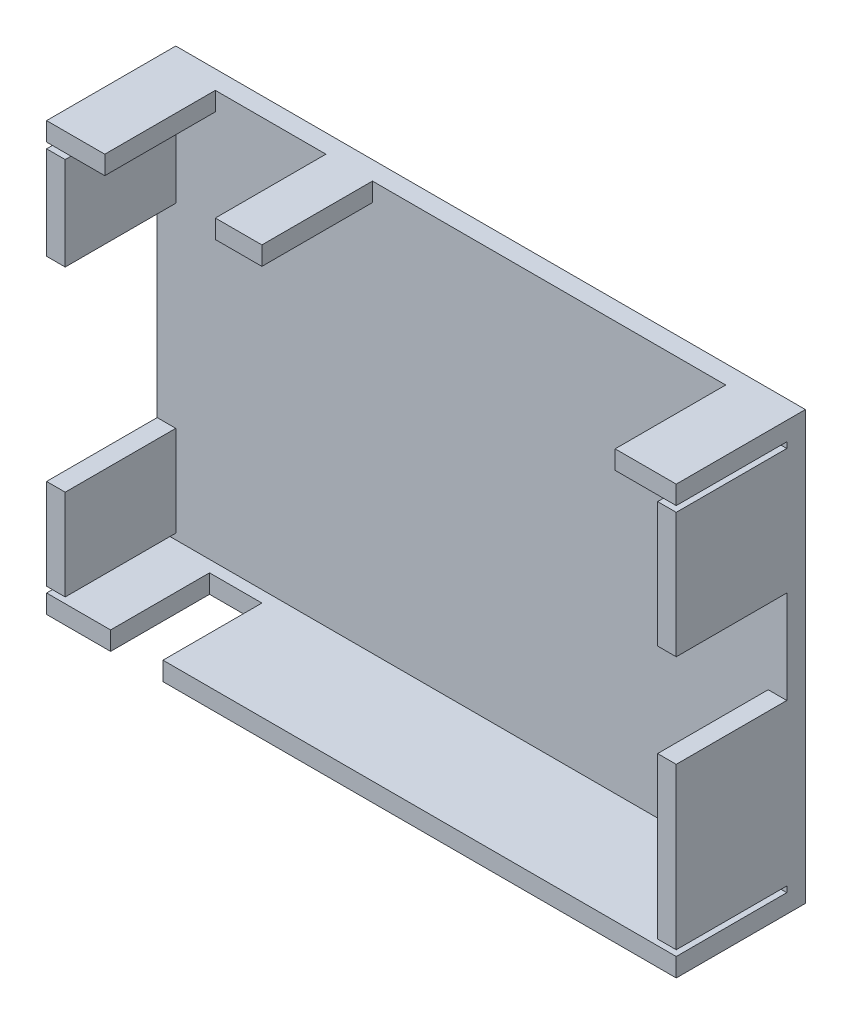
ISO-10303-21;
HEADER;
FILE_DESCRIPTION(('STEP AP214'),'2;1');
FILE_NAME('part.step','',(''),(''),'','','');
FILE_SCHEMA(('AUTOMOTIVE_DESIGN { 1 0 10303 214 1 1 1 1 }'));
ENDSEC;
DATA;
#1=APPLICATION_CONTEXT('core data for automotive mechanical design processes');
#2=APPLICATION_PROTOCOL_DEFINITION('international standard','automotive_design',2000,#1);
#3=PRODUCT_CONTEXT('',#1,'mechanical');
#4=PRODUCT('Part','Part','',(#3));
#5=PRODUCT_RELATED_PRODUCT_CATEGORY('part','',(#4));
#6=PRODUCT_DEFINITION_FORMATION('','',#4);
#7=PRODUCT_DEFINITION_CONTEXT('part definition',#1,'design');
#8=PRODUCT_DEFINITION('design','',#6,#7);
#9=PRODUCT_DEFINITION_SHAPE('','',#8);
#10=(LENGTH_UNIT() NAMED_UNIT(*) SI_UNIT(.MILLI.,.METRE.));
#11=(NAMED_UNIT(*) PLANE_ANGLE_UNIT() SI_UNIT($,.RADIAN.));
#12=(NAMED_UNIT(*) SI_UNIT($,.STERADIAN.) SOLID_ANGLE_UNIT());
#13=UNCERTAINTY_MEASURE_WITH_UNIT(LENGTH_MEASURE(1.E-05),#10,'distance_accuracy_value','');
#14=(GEOMETRIC_REPRESENTATION_CONTEXT(3) GLOBAL_UNCERTAINTY_ASSIGNED_CONTEXT((#13)) GLOBAL_UNIT_ASSIGNED_CONTEXT((#10,
#11,#12)) REPRESENTATION_CONTEXT('',''));
#15=CARTESIAN_POINT('',(0.,0.,0.));
#16=DIRECTION('',(0.,0.,1.));
#17=DIRECTION('',(1.,0.,0.));
#18=AXIS2_PLACEMENT_3D('',#15,#16,#17);
#19=CARTESIAN_POINT('',(0.,0.,22.2));
#20=DIRECTION('',(0.,0.,1.));
#21=DIRECTION('',(1.,0.,0.));
#22=AXIS2_PLACEMENT_3D('',#19,#20,#21);
#23=PLANE('',#22);
#24=DIRECTION('',(0.,1.,0.));
#25=VECTOR('',#24,1.);
#26=CARTESIAN_POINT('',(20.,3.19999999999998,22.2));
#27=LINE('',#26,#25);
#28=CARTESIAN_POINT('',(20.,0.,22.2));
#29=VERTEX_POINT('',#28);
#30=CARTESIAN_POINT('',(20.,3.19999999999998,22.2));
#31=VERTEX_POINT('',#30);
#32=EDGE_CURVE('E284',#29,#31,#27,.T.);
#33=ORIENTED_EDGE('',*,*,#32,.F.);
#34=DIRECTION('',(1.,0.,0.));
#35=VECTOR('',#34,1.);
#36=CARTESIAN_POINT('',(0.,0.,22.2));
#37=LINE('',#36,#35);
#38=CARTESIAN_POINT('',(108.2,0.,22.2));
#39=VERTEX_POINT('',#38);
#40=EDGE_CURVE('E487',#29,#39,#37,.T.);
#41=ORIENTED_EDGE('',*,*,#40,.T.);
#42=DIRECTION('',(0.,1.,0.));
#43=VECTOR('',#42,1.);
#44=CARTESIAN_POINT('',(108.2,0.,22.2));
#45=LINE('',#44,#43);
#46=CARTESIAN_POINT('',(108.2,3.2,22.2));
#47=VERTEX_POINT('',#46);
#48=EDGE_CURVE('E494',#39,#47,#45,.T.);
#49=ORIENTED_EDGE('',*,*,#48,.T.);
#50=DIRECTION('',(1.,0.,0.));
#51=VECTOR('',#50,1.);
#52=CARTESIAN_POINT('',(3.20000000000001,3.2,22.2));
#53=LINE('',#52,#51);
#54=EDGE_CURVE('E452',#31,#47,#53,.T.);
#55=ORIENTED_EDGE('',*,*,#54,.F.);
#56=EDGE_LOOP('',(#33,#41,#49,#55));
#57=FACE_BOUND('',#56,.T.);
#58=ADVANCED_FACE('F36',(#57),#23,.T.);
#59=DIRECTION('',(-1.,0.,0.));
#60=VECTOR('',#59,1.);
#61=CARTESIAN_POINT('',(105.,47.8,22.2));
#62=LINE('',#61,#60);
#63=CARTESIAN_POINT('',(108.2,47.8,22.2));
#64=VERTEX_POINT('',#63);
#65=CARTESIAN_POINT('',(105.,47.8,22.2));
#66=VERTEX_POINT('',#65);
#67=EDGE_CURVE('E300',#64,#66,#62,.T.);
#68=ORIENTED_EDGE('',*,*,#67,.F.);
#69=CARTESIAN_POINT('',(108.2,69.3,22.2));
#70=VERTEX_POINT('',#69);
#71=EDGE_CURVE('E499',#64,#70,#45,.T.);
#72=ORIENTED_EDGE('',*,*,#71,.T.);
#73=DIRECTION('',(-1.,0.,0.));
#74=VECTOR('',#73,1.);
#75=CARTESIAN_POINT('',(0.,69.3,22.2));
#76=LINE('',#75,#74);
#77=CARTESIAN_POINT('',(105.,69.3,22.2));
#78=VERTEX_POINT('',#77);
#79=EDGE_CURVE('E395',#70,#78,#76,.T.);
#80=ORIENTED_EDGE('',*,*,#79,.T.);
#81=DIRECTION('',(0.,1.,0.));
#82=VECTOR('',#81,1.);
#83=CARTESIAN_POINT('',(105.,3.2,22.2));
#84=LINE('',#83,#82);
#85=EDGE_CURVE('E455',#66,#78,#84,.T.);
#86=ORIENTED_EDGE('',*,*,#85,.F.);
#87=EDGE_LOOP('',(#68,#72,#80,#86));
#88=FACE_BOUND('',#87,.T.);
#89=ADVANCED_FACE('F645',(#88),#23,.T.);
#90=CARTESIAN_POINT('',(105.,3.2,22.2));
#91=DIRECTION('',(-1.,0.,0.));
#92=DIRECTION('',(0.,0.,1.));
#93=AXIS2_PLACEMENT_3D('',#90,#91,#92);
#94=PLANE('',#93);
#95=DIRECTION('',(0.,0.,1.));
#96=VECTOR('',#95,1.);
#97=CARTESIAN_POINT('',(105.,47.8,3.2));
#98=LINE('',#97,#96);
#99=CARTESIAN_POINT('',(105.,47.8,3.2));
#100=VERTEX_POINT('',#99);
#101=EDGE_CURVE('E308',#100,#66,#98,.T.);
#102=ORIENTED_EDGE('',*,*,#101,.T.);
#103=ORIENTED_EDGE('',*,*,#85,.T.);
#104=DIRECTION('',(0.,0.,1.));
#105=VECTOR('',#104,1.);
#106=CARTESIAN_POINT('',(105.,69.3,3.2));
#107=LINE('',#106,#105);
#108=CARTESIAN_POINT('',(105.,69.3,3.2));
#109=VERTEX_POINT('',#108);
#110=EDGE_CURVE('E391',#109,#78,#107,.T.);
#111=ORIENTED_EDGE('',*,*,#110,.F.);
#112=DIRECTION('',(0.,1.,0.));
#113=VECTOR('',#112,1.);
#114=CARTESIAN_POINT('',(105.,3.2,3.2));
#115=LINE('',#114,#113);
#116=EDGE_CURVE('E470',#100,#109,#115,.T.);
#117=ORIENTED_EDGE('',*,*,#116,.F.);
#118=EDGE_LOOP('',(#102,#103,#111,#117));
#119=FACE_BOUND('',#118,.T.);
#120=ADVANCED_FACE('F641',(#119),#94,.T.);
#121=DIRECTION('',(0.,1.,0.));
#122=VECTOR('',#121,1.);
#123=CARTESIAN_POINT('',(29.,73.5,22.2));
#124=LINE('',#123,#122);
#125=CARTESIAN_POINT('',(29.,70.3,22.2));
#126=VERTEX_POINT('',#125);
#127=CARTESIAN_POINT('',(29.,73.5,22.2));
#128=VERTEX_POINT('',#127);
#129=EDGE_CURVE('E322',#126,#128,#124,.T.);
#130=ORIENTED_EDGE('',*,*,#129,.F.);
#131=DIRECTION('',(-1.,0.,0.));
#132=VECTOR('',#131,1.);
#133=CARTESIAN_POINT('',(3.20000000000001,70.3,22.2));
#134=LINE('',#133,#132);
#135=CARTESIAN_POINT('',(37.,70.3,22.2));
#136=VERTEX_POINT('',#135);
#137=EDGE_CURVE('E464',#136,#126,#134,.T.);
#138=ORIENTED_EDGE('',*,*,#137,.F.);
#139=DIRECTION('',(0.,-1.,0.));
#140=VECTOR('',#139,1.);
#141=CARTESIAN_POINT('',(37.,73.5,22.2));
#142=LINE('',#141,#140);
#143=CARTESIAN_POINT('',(37.,73.5,22.2));
#144=VERTEX_POINT('',#143);
#145=EDGE_CURVE('E311',#144,#136,#142,.T.);
#146=ORIENTED_EDGE('',*,*,#145,.F.);
#147=DIRECTION('',(-1.,0.,0.));
#148=VECTOR('',#147,1.);
#149=CARTESIAN_POINT('',(108.2,73.5,22.2));
#150=LINE('',#149,#148);
#151=EDGE_CURVE('E483',#144,#128,#150,.T.);
#152=ORIENTED_EDGE('',*,*,#151,.T.);
#153=EDGE_LOOP('',(#130,#138,#146,#152));
#154=FACE_BOUND('',#153,.T.);
#155=ADVANCED_FACE('F549',(#154),#23,.T.);
#156=DIRECTION('',(0.,1.,0.));
#157=VECTOR('',#156,1.);
#158=CARTESIAN_POINT('',(97.7,73.5,22.2));
#159=LINE('',#158,#157);
#160=CARTESIAN_POINT('',(97.7,70.3,22.2));
#161=VERTEX_POINT('',#160);
#162=CARTESIAN_POINT('',(97.7,73.5,22.2));
#163=VERTEX_POINT('',#162);
#164=EDGE_CURVE('E346',#161,#163,#159,.T.);
#165=ORIENTED_EDGE('',*,*,#164,.F.);
#166=CARTESIAN_POINT('',(108.2,70.3,22.2));
#167=VERTEX_POINT('',#166);
#168=EDGE_CURVE('E460',#167,#161,#134,.T.);
#169=ORIENTED_EDGE('',*,*,#168,.F.);
#170=CARTESIAN_POINT('',(108.2,73.5,22.2));
#171=VERTEX_POINT('',#170);
#172=EDGE_CURVE('E493',#167,#171,#45,.T.);
#173=ORIENTED_EDGE('',*,*,#172,.T.);
#174=EDGE_CURVE('E479',#171,#163,#150,.T.);
#175=ORIENTED_EDGE('',*,*,#174,.T.);
#176=EDGE_LOOP('',(#165,#169,#173,#175));
#177=FACE_BOUND('',#176,.T.);
#178=ADVANCED_FACE('F625',(#177),#23,.T.);
#179=CARTESIAN_POINT('',(3.20000000000001,70.3,22.2));
#180=DIRECTION('',(0.,-1.,0.));
#181=DIRECTION('',(0.,0.,-1.));
#182=AXIS2_PLACEMENT_3D('',#179,#180,#181);
#183=PLANE('',#182);
#184=DIRECTION('',(0.,0.,1.));
#185=VECTOR('',#184,1.);
#186=CARTESIAN_POINT('',(29.,70.3,3.2));
#187=LINE('',#186,#185);
#188=CARTESIAN_POINT('',(29.,70.3,3.2));
#189=VERTEX_POINT('',#188);
#190=EDGE_CURVE('E336',#189,#126,#187,.T.);
#191=ORIENTED_EDGE('',*,*,#190,.F.);
#192=DIRECTION('',(-1.,0.,0.));
#193=VECTOR('',#192,1.);
#194=CARTESIAN_POINT('',(3.20000000000001,70.3,3.2));
#195=LINE('',#194,#193);
#196=CARTESIAN_POINT('',(37.,70.3,3.2));
#197=VERTEX_POINT('',#196);
#198=EDGE_CURVE('E478',#197,#189,#195,.T.);
#199=ORIENTED_EDGE('',*,*,#198,.F.);
#200=DIRECTION('',(0.,0.,1.));
#201=VECTOR('',#200,1.);
#202=CARTESIAN_POINT('',(37.,70.3,3.2));
#203=LINE('',#202,#201);
#204=EDGE_CURVE('E358',#197,#136,#203,.T.);
#205=ORIENTED_EDGE('',*,*,#204,.T.);
#206=ORIENTED_EDGE('',*,*,#137,.T.);
#207=EDGE_LOOP('',(#191,#199,#205,#206));
#208=FACE_BOUND('',#207,.T.);
#209=ADVANCED_FACE('F817',(#208),#183,.T.);
#210=DIRECTION('',(0.,0.,1.));
#211=VECTOR('',#210,1.);
#212=CARTESIAN_POINT('',(97.7,70.3,3.2));
#213=LINE('',#212,#211);
#214=CARTESIAN_POINT('',(97.7,70.3,3.2));
#215=VERTEX_POINT('',#214);
#216=EDGE_CURVE('E356',#215,#161,#213,.T.);
#217=ORIENTED_EDGE('',*,*,#216,.F.);
#218=CARTESIAN_POINT('',(108.2,70.3,3.2));
#219=VERTEX_POINT('',#218);
#220=EDGE_CURVE('E475',#219,#215,#195,.T.);
#221=ORIENTED_EDGE('',*,*,#220,.F.);
#222=DIRECTION('',(0.,0.,1.));
#223=VECTOR('',#222,1.);
#224=CARTESIAN_POINT('',(108.2,70.3,3.2));
#225=LINE('',#224,#223);
#226=EDGE_CURVE('E388',#219,#167,#225,.T.);
#227=ORIENTED_EDGE('',*,*,#226,.T.);
#228=ORIENTED_EDGE('',*,*,#168,.T.);
#229=EDGE_LOOP('',(#217,#221,#227,#228));
#230=FACE_BOUND('',#229,.T.);
#231=ADVANCED_FACE('F633',(#230),#183,.T.);
#232=DIRECTION('',(-1.,0.,0.));
#233=VECTOR('',#232,1.);
#234=CARTESIAN_POINT('',(0.,53.3,22.2));
#235=LINE('',#234,#233);
#236=CARTESIAN_POINT('',(3.20000000000001,53.3,22.2));
#237=VERTEX_POINT('',#236);
#238=CARTESIAN_POINT('',(0.,53.3,22.2));
#239=VERTEX_POINT('',#238);
#240=EDGE_CURVE('E366',#237,#239,#235,.T.);
#241=ORIENTED_EDGE('',*,*,#240,.F.);
#242=DIRECTION('',(0.,-1.,0.));
#243=VECTOR('',#242,1.);
#244=CARTESIAN_POINT('',(3.20000000000001,3.2,22.2));
#245=LINE('',#244,#243);
#246=CARTESIAN_POINT('',(3.20000000000001,69.3,22.2));
#247=VERTEX_POINT('',#246);
#248=EDGE_CURVE('E449',#247,#237,#245,.T.);
#249=ORIENTED_EDGE('',*,*,#248,.F.);
#250=DIRECTION('',(1.,0.,0.));
#251=VECTOR('',#250,1.);
#252=CARTESIAN_POINT('',(0.,69.3,22.2));
#253=LINE('',#252,#251);
#254=CARTESIAN_POINT('',(0.,69.3,22.2));
#255=VERTEX_POINT('',#254);
#256=EDGE_CURVE('E398',#255,#247,#253,.T.);
#257=ORIENTED_EDGE('',*,*,#256,.F.);
#258=DIRECTION('',(0.,-1.,0.));
#259=VECTOR('',#258,1.);
#260=CARTESIAN_POINT('',(0.,73.5,22.2));
#261=LINE('',#260,#259);
#262=EDGE_CURVE('E488',#255,#239,#261,.T.);
#263=ORIENTED_EDGE('',*,*,#262,.T.);
#264=EDGE_LOOP('',(#241,#249,#257,#263));
#265=FACE_BOUND('',#264,.T.);
#266=ADVANCED_FACE('F576',(#265),#23,.T.);
#267=CARTESIAN_POINT('',(3.20000000000001,3.2,22.2));
#268=DIRECTION('',(1.,0.,0.));
#269=DIRECTION('',(0.,1.,0.));
#270=AXIS2_PLACEMENT_3D('',#267,#268,#269);
#271=PLANE('',#270);
#272=DIRECTION('',(0.,0.,1.));
#273=VECTOR('',#272,1.);
#274=CARTESIAN_POINT('',(3.20000000000001,53.3,3.2));
#275=LINE('',#274,#273);
#276=CARTESIAN_POINT('',(3.20000000000001,53.3,3.2));
#277=VERTEX_POINT('',#276);
#278=EDGE_CURVE('E378',#277,#237,#275,.T.);
#279=ORIENTED_EDGE('',*,*,#278,.F.);
#280=DIRECTION('',(0.,-1.,0.));
#281=VECTOR('',#280,1.);
#282=CARTESIAN_POINT('',(3.20000000000001,3.2,3.2));
#283=LINE('',#282,#281);
#284=CARTESIAN_POINT('',(3.20000000000001,69.3,3.2));
#285=VERTEX_POINT('',#284);
#286=EDGE_CURVE('E465',#285,#277,#283,.T.);
#287=ORIENTED_EDGE('',*,*,#286,.F.);
#288=DIRECTION('',(0.,0.,1.));
#289=VECTOR('',#288,1.);
#290=CARTESIAN_POINT('',(3.20000000000001,69.3,3.2));
#291=LINE('',#290,#289);
#292=EDGE_CURVE('E445',#285,#247,#291,.T.);
#293=ORIENTED_EDGE('',*,*,#292,.T.);
#294=ORIENTED_EDGE('',*,*,#248,.T.);
#295=EDGE_LOOP('',(#279,#287,#293,#294));
#296=FACE_BOUND('',#295,.T.);
#297=ADVANCED_FACE('F579',(#296),#271,.T.);
#298=CARTESIAN_POINT('',(0.,0.,3.2));
#299=DIRECTION('',(1.,0.,0.));
#300=DIRECTION('',(0.,0.,-1.));
#301=AXIS2_PLACEMENT_3D('',#298,#299,#300);
#302=PLANE('',#301);
#303=DIRECTION('',(0.,-1.,0.));
#304=VECTOR('',#303,1.);
#305=CARTESIAN_POINT('',(0.,53.3,3.2));
#306=LINE('',#305,#304);
#307=CARTESIAN_POINT('',(0.,53.3,3.2));
#308=VERTEX_POINT('',#307);
#309=CARTESIAN_POINT('',(0.,19.8,3.2));
#310=VERTEX_POINT('',#309);
#311=EDGE_CURVE('E362',#308,#310,#306,.T.);
#312=ORIENTED_EDGE('',*,*,#311,.F.);
#313=DIRECTION('',(0.,0.,1.));
#314=VECTOR('',#313,1.);
#315=CARTESIAN_POINT('',(0.,53.3,3.2));
#316=LINE('',#315,#314);
#317=EDGE_CURVE('E374',#308,#239,#316,.T.);
#318=ORIENTED_EDGE('',*,*,#317,.T.);
#319=ORIENTED_EDGE('',*,*,#262,.F.);
#320=DIRECTION('',(0.,0.,1.));
#321=VECTOR('',#320,1.);
#322=CARTESIAN_POINT('',(0.,69.3,3.2));
#323=LINE('',#322,#321);
#324=CARTESIAN_POINT('',(0.,69.3,3.2));
#325=VERTEX_POINT('',#324);
#326=EDGE_CURVE('E439',#325,#255,#323,.T.);
#327=ORIENTED_EDGE('',*,*,#326,.F.);
#328=DIRECTION('',(0.,-1.,0.));
#329=VECTOR('',#328,1.);
#330=CARTESIAN_POINT('',(0.,0.,3.2));
#331=LINE('',#330,#329);
#332=CARTESIAN_POINT('',(0.,70.3,3.2));
#333=VERTEX_POINT('',#332);
#334=EDGE_CURVE('E434',#333,#325,#331,.T.);
#335=ORIENTED_EDGE('',*,*,#334,.F.);
#336=DIRECTION('',(0.,0.,1.));
#337=VECTOR('',#336,1.);
#338=CARTESIAN_POINT('',(0.,70.3,3.2));
#339=LINE('',#338,#337);
#340=CARTESIAN_POINT('',(0.,70.3,22.2));
#341=VERTEX_POINT('',#340);
#342=EDGE_CURVE('E441',#333,#341,#339,.T.);
#343=ORIENTED_EDGE('',*,*,#342,.T.);
#344=CARTESIAN_POINT('',(0.,73.5,22.2));
#345=VERTEX_POINT('',#344);
#346=EDGE_CURVE('E484',#345,#341,#261,.T.);
#347=ORIENTED_EDGE('',*,*,#346,.F.);
#348=DIRECTION('',(0.,0.,-1.));
#349=VECTOR('',#348,1.);
#350=CARTESIAN_POINT('',(0.,73.5,3.2));
#351=LINE('',#350,#349);
#352=CARTESIAN_POINT('',(0.,73.5,0.));
#353=VERTEX_POINT('',#352);
#354=EDGE_CURVE('E508',#345,#353,#351,.T.);
#355=ORIENTED_EDGE('',*,*,#354,.T.);
#356=DIRECTION('',(0.,-1.,0.));
#357=VECTOR('',#356,1.);
#358=CARTESIAN_POINT('',(0.,0.,0.));
#359=LINE('',#358,#357);
#360=CARTESIAN_POINT('',(0.,0.,0.));
#361=VERTEX_POINT('',#360);
#362=EDGE_CURVE('E497',#353,#361,#359,.T.);
#363=ORIENTED_EDGE('',*,*,#362,.T.);
#364=DIRECTION('',(0.,0.,-1.));
#365=VECTOR('',#364,1.);
#366=CARTESIAN_POINT('',(0.,0.,3.2));
#367=LINE('',#366,#365);
#368=CARTESIAN_POINT('',(0.,0.,22.2));
#369=VERTEX_POINT('',#368);
#370=EDGE_CURVE('E11',#369,#361,#367,.T.);
#371=ORIENTED_EDGE('',*,*,#370,.F.);
#372=CARTESIAN_POINT('',(0.,3.2,22.2));
#373=VERTEX_POINT('',#372);
#374=EDGE_CURVE('E482',#373,#369,#261,.T.);
#375=ORIENTED_EDGE('',*,*,#374,.F.);
#376=DIRECTION('',(0.,0.,1.));
#377=VECTOR('',#376,1.);
#378=CARTESIAN_POINT('',(0.,3.2,3.2));
#379=LINE('',#378,#377);
#380=CARTESIAN_POINT('',(0.,3.2,3.2));
#381=VERTEX_POINT('',#380);
#382=EDGE_CURVE('E424',#381,#373,#379,.T.);
#383=ORIENTED_EDGE('',*,*,#382,.F.);
#384=DIRECTION('',(0.,1.,0.));
#385=VECTOR('',#384,1.);
#386=CARTESIAN_POINT('',(0.,3.2,3.2));
#387=LINE('',#386,#385);
#388=CARTESIAN_POINT('',(0.,4.2,3.2));
#389=VERTEX_POINT('',#388);
#390=EDGE_CURVE('E429',#381,#389,#387,.T.);
#391=ORIENTED_EDGE('',*,*,#390,.T.);
#392=DIRECTION('',(0.,0.,1.));
#393=VECTOR('',#392,1.);
#394=CARTESIAN_POINT('',(0.,4.2,3.2));
#395=LINE('',#394,#393);
#396=CARTESIAN_POINT('',(0.,4.2,22.2));
#397=VERTEX_POINT('',#396);
#398=EDGE_CURVE('E377',#389,#397,#395,.T.);
#399=ORIENTED_EDGE('',*,*,#398,.T.);
#400=CARTESIAN_POINT('',(0.,19.8,22.2));
#401=VERTEX_POINT('',#400);
#402=EDGE_CURVE('E489',#401,#397,#261,.T.);
#403=ORIENTED_EDGE('',*,*,#402,.F.);
#404=DIRECTION('',(0.,0.,1.));
#405=VECTOR('',#404,1.);
#406=CARTESIAN_POINT('',(0.,19.8,3.2));
#407=LINE('',#406,#405);
#408=EDGE_CURVE('E371',#310,#401,#407,.T.);
#409=ORIENTED_EDGE('',*,*,#408,.F.);
#410=EDGE_LOOP('',(#312,#318,#319,#327,#335,#343,#347,#355,#363,#371,#375,#383,#391,#399,#403,#409));
#411=FACE_BOUND('',#410,.T.);
#412=ADVANCED_FACE('F38',(#411),#302,.F.);
#413=CARTESIAN_POINT('',(108.2,0.,3.2));
#414=DIRECTION('',(-1.,0.,0.));
#415=DIRECTION('',(0.,0.,1.));
#416=AXIS2_PLACEMENT_3D('',#413,#414,#415);
#417=PLANE('',#416);
#418=ORIENTED_EDGE('',*,*,#71,.F.);
#419=DIRECTION('',(0.,0.,1.));
#420=VECTOR('',#419,1.);
#421=CARTESIAN_POINT('',(108.2,47.8,3.2));
#422=LINE('',#421,#420);
#423=CARTESIAN_POINT('',(108.2,47.8,3.2));
#424=VERTEX_POINT('',#423);
#425=EDGE_CURVE('E312',#424,#64,#422,.T.);
#426=ORIENTED_EDGE('',*,*,#425,.F.);
#427=DIRECTION('',(0.,1.,0.));
#428=VECTOR('',#427,1.);
#429=CARTESIAN_POINT('',(108.2,31.8,3.2));
#430=LINE('',#429,#428);
#431=CARTESIAN_POINT('',(108.2,31.8,3.2));
#432=VERTEX_POINT('',#431);
#433=EDGE_CURVE('E299',#432,#424,#430,.T.);
#434=ORIENTED_EDGE('',*,*,#433,.F.);
#435=DIRECTION('',(0.,0.,1.));
#436=VECTOR('',#435,1.);
#437=CARTESIAN_POINT('',(108.2,31.8,3.2));
#438=LINE('',#437,#436);
#439=CARTESIAN_POINT('',(108.2,31.8,22.2));
#440=VERTEX_POINT('',#439);
#441=EDGE_CURVE('E314',#432,#440,#438,.T.);
#442=ORIENTED_EDGE('',*,*,#441,.T.);
#443=CARTESIAN_POINT('',(108.2,4.2,22.2));
#444=VERTEX_POINT('',#443);
#445=EDGE_CURVE('E498',#444,#440,#45,.T.);
#446=ORIENTED_EDGE('',*,*,#445,.F.);
#447=DIRECTION('',(0.,0.,1.));
#448=VECTOR('',#447,1.);
#449=CARTESIAN_POINT('',(108.2,4.2,3.2));
#450=LINE('',#449,#448);
#451=CARTESIAN_POINT('',(108.2,4.2,3.2));
#452=VERTEX_POINT('',#451);
#453=EDGE_CURVE('E404',#452,#444,#450,.T.);
#454=ORIENTED_EDGE('',*,*,#453,.F.);
#455=DIRECTION('',(0.,1.,0.));
#456=VECTOR('',#455,1.);
#457=CARTESIAN_POINT('',(108.2,0.,3.2));
#458=LINE('',#457,#456);
#459=CARTESIAN_POINT('',(108.2,3.2,3.2));
#460=VERTEX_POINT('',#459);
#461=EDGE_CURVE('E415',#460,#452,#458,.T.);
#462=ORIENTED_EDGE('',*,*,#461,.F.);
#463=DIRECTION('',(0.,0.,1.));
#464=VECTOR('',#463,1.);
#465=CARTESIAN_POINT('',(108.2,3.2,3.2));
#466=LINE('',#465,#464);
#467=EDGE_CURVE('E410',#460,#47,#466,.T.);
#468=ORIENTED_EDGE('',*,*,#467,.T.);
#469=ORIENTED_EDGE('',*,*,#48,.F.);
#470=DIRECTION('',(0.,0.,-1.));
#471=VECTOR('',#470,1.);
#472=CARTESIAN_POINT('',(108.2,0.,3.2));
#473=LINE('',#472,#471);
#474=CARTESIAN_POINT('',(108.2,0.,0.));
#475=VERTEX_POINT('',#474);
#476=EDGE_CURVE('E44',#39,#475,#473,.T.);
#477=ORIENTED_EDGE('',*,*,#476,.T.);
#478=DIRECTION('',(0.,1.,0.));
#479=VECTOR('',#478,1.);
#480=CARTESIAN_POINT('',(108.2,0.,0.));
#481=LINE('',#480,#479);
#482=CARTESIAN_POINT('',(108.2,73.5,0.));
#483=VERTEX_POINT('',#482);
#484=EDGE_CURVE('E504',#475,#483,#481,.T.);
#485=ORIENTED_EDGE('',*,*,#484,.T.);
#486=DIRECTION('',(0.,0.,-1.));
#487=VECTOR('',#486,1.);
#488=CARTESIAN_POINT('',(108.2,73.5,3.2));
#489=LINE('',#488,#487);
#490=EDGE_CURVE('E511',#171,#483,#489,.T.);
#491=ORIENTED_EDGE('',*,*,#490,.F.);
#492=ORIENTED_EDGE('',*,*,#172,.F.);
#493=ORIENTED_EDGE('',*,*,#226,.F.);
#494=DIRECTION('',(0.,1.,0.));
#495=VECTOR('',#494,1.);
#496=CARTESIAN_POINT('',(108.2,0.,3.2));
#497=LINE('',#496,#495);
#498=CARTESIAN_POINT('',(108.2,69.3,3.2));
#499=VERTEX_POINT('',#498);
#500=EDGE_CURVE('E387',#499,#219,#497,.T.);
#501=ORIENTED_EDGE('',*,*,#500,.F.);
#502=DIRECTION('',(0.,0.,1.));
#503=VECTOR('',#502,1.);
#504=CARTESIAN_POINT('',(108.2,69.3,3.2));
#505=LINE('',#504,#503);
#506=EDGE_CURVE('E384',#499,#70,#505,.T.);
#507=ORIENTED_EDGE('',*,*,#506,.T.);
#508=EDGE_LOOP('',(#418,#426,#434,#442,#446,#454,#462,#468,#469,#477,#485,#491,#492,#493,#501,#507));
#509=FACE_BOUND('',#508,.T.);
#510=ADVANCED_FACE('F519',(#509),#417,.F.);
#511=DIRECTION('',(1.,0.,0.));
#512=VECTOR('',#511,1.);
#513=CARTESIAN_POINT('',(0.,19.8,22.2));
#514=LINE('',#513,#512);
#515=CARTESIAN_POINT('',(3.20000000000001,19.8,22.2));
#516=VERTEX_POINT('',#515);
#517=EDGE_CURVE('E335',#401,#516,#514,.T.);
#518=ORIENTED_EDGE('',*,*,#517,.F.);
#519=ORIENTED_EDGE('',*,*,#402,.T.);
#520=DIRECTION('',(1.,0.,0.));
#521=VECTOR('',#520,1.);
#522=CARTESIAN_POINT('',(0.,4.2,22.2));
#523=LINE('',#522,#521);
#524=CARTESIAN_POINT('',(3.20000000000001,4.2,22.2));
#525=VERTEX_POINT('',#524);
#526=EDGE_CURVE('E413',#397,#525,#523,.T.);
#527=ORIENTED_EDGE('',*,*,#526,.T.);
#528=EDGE_CURVE('E453',#516,#525,#245,.T.);
#529=ORIENTED_EDGE('',*,*,#528,.F.);
#530=EDGE_LOOP('',(#518,#519,#527,#529));
#531=FACE_BOUND('',#530,.T.);
#532=ADVANCED_FACE('F590',(#531),#23,.T.);
#533=DIRECTION('',(0.,-1.,0.));
#534=VECTOR('',#533,1.);
#535=CARTESIAN_POINT('',(11.,3.19999999999998,22.2));
#536=LINE('',#535,#534);
#537=CARTESIAN_POINT('',(11.,3.19999999999998,22.2));
#538=VERTEX_POINT('',#537);
#539=CARTESIAN_POINT('',(11.,0.,22.2));
#540=VERTEX_POINT('',#539);
#541=EDGE_CURVE('E1001',#538,#540,#536,.T.);
#542=ORIENTED_EDGE('',*,*,#541,.F.);
#543=EDGE_CURVE('E289',#373,#538,#53,.T.);
#544=ORIENTED_EDGE('',*,*,#543,.F.);
#545=ORIENTED_EDGE('',*,*,#374,.T.);
#546=EDGE_CURVE('E490',#369,#540,#37,.T.);
#547=ORIENTED_EDGE('',*,*,#546,.T.);
#548=EDGE_LOOP('',(#542,#544,#545,#547));
#549=FACE_BOUND('',#548,.T.);
#550=ADVANCED_FACE('F671',(#549),#23,.T.);
#551=DIRECTION('',(1.,0.,0.));
#552=VECTOR('',#551,1.);
#553=CARTESIAN_POINT('',(105.,31.8,22.2));
#554=LINE('',#553,#552);
#555=CARTESIAN_POINT('',(105.,31.8,22.2));
#556=VERTEX_POINT('',#555);
#557=EDGE_CURVE('E304',#556,#440,#554,.T.);
#558=ORIENTED_EDGE('',*,*,#557,.F.);
#559=CARTESIAN_POINT('',(105.,4.2,22.2));
#560=VERTEX_POINT('',#559);
#561=EDGE_CURVE('E456',#560,#556,#84,.T.);
#562=ORIENTED_EDGE('',*,*,#561,.F.);
#563=DIRECTION('',(-1.,0.,0.));
#564=VECTOR('',#563,1.);
#565=CARTESIAN_POINT('',(0.,4.2,22.2));
#566=LINE('',#565,#564);
#567=EDGE_CURVE('E394',#444,#560,#566,.T.);
#568=ORIENTED_EDGE('',*,*,#567,.F.);
#569=ORIENTED_EDGE('',*,*,#445,.T.);
#570=EDGE_LOOP('',(#558,#562,#568,#569));
#571=FACE_BOUND('',#570,.T.);
#572=ADVANCED_FACE('F621',(#571),#23,.T.);
#573=DIRECTION('',(0.,-1.,0.));
#574=VECTOR('',#573,1.);
#575=CARTESIAN_POINT('',(10.,73.5,22.2));
#576=LINE('',#575,#574);
#577=CARTESIAN_POINT('',(10.,73.5,22.2));
#578=VERTEX_POINT('',#577);
#579=CARTESIAN_POINT('',(10.,70.3,22.2));
#580=VERTEX_POINT('',#579);
#581=EDGE_CURVE('E328',#578,#580,#576,.T.);
#582=ORIENTED_EDGE('',*,*,#581,.F.);
#583=EDGE_CURVE('E463',#578,#345,#150,.T.);
#584=ORIENTED_EDGE('',*,*,#583,.T.);
#585=ORIENTED_EDGE('',*,*,#346,.T.);
#586=EDGE_CURVE('E459',#580,#341,#134,.T.);
#587=ORIENTED_EDGE('',*,*,#586,.F.);
#588=EDGE_LOOP('',(#582,#584,#585,#587));
#589=FACE_BOUND('',#588,.T.);
#590=ADVANCED_FACE('F542',(#589),#23,.T.);
#591=DIRECTION('',(0.,0.,1.));
#592=VECTOR('',#591,1.);
#593=CARTESIAN_POINT('',(3.20000000000001,19.8,3.2));
#594=LINE('',#593,#592);
#595=CARTESIAN_POINT('',(3.20000000000001,19.8,3.2));
#596=VERTEX_POINT('',#595);
#597=EDGE_CURVE('E380',#596,#516,#594,.T.);
#598=ORIENTED_EDGE('',*,*,#597,.T.);
#599=ORIENTED_EDGE('',*,*,#528,.T.);
#600=DIRECTION('',(0.,0.,1.));
#601=VECTOR('',#600,1.);
#602=CARTESIAN_POINT('',(3.20000000000001,4.2,3.2));
#603=LINE('',#602,#601);
#604=CARTESIAN_POINT('',(3.20000000000001,4.2,3.2));
#605=VERTEX_POINT('',#604);
#606=EDGE_CURVE('E421',#605,#525,#603,.T.);
#607=ORIENTED_EDGE('',*,*,#606,.F.);
#608=EDGE_CURVE('E444',#596,#605,#283,.T.);
#609=ORIENTED_EDGE('',*,*,#608,.F.);
#610=EDGE_LOOP('',(#598,#599,#607,#609));
#611=FACE_BOUND('',#610,.T.);
#612=ADVANCED_FACE('F594',(#611),#271,.T.);
#613=DIRECTION('',(0.,0.,1.));
#614=VECTOR('',#613,1.);
#615=CARTESIAN_POINT('',(105.,31.8,3.2));
#616=LINE('',#615,#614);
#617=CARTESIAN_POINT('',(105.,31.8,3.2));
#618=VERTEX_POINT('',#617);
#619=EDGE_CURVE('E303',#618,#556,#616,.T.);
#620=ORIENTED_EDGE('',*,*,#619,.F.);
#621=CARTESIAN_POINT('',(105.,4.2,3.2));
#622=VERTEX_POINT('',#621);
#623=EDGE_CURVE('E471',#622,#618,#115,.T.);
#624=ORIENTED_EDGE('',*,*,#623,.F.);
#625=DIRECTION('',(0.,0.,1.));
#626=VECTOR('',#625,1.);
#627=CARTESIAN_POINT('',(105.,4.2,3.2));
#628=LINE('',#627,#626);
#629=EDGE_CURVE('E407',#622,#560,#628,.T.);
#630=ORIENTED_EDGE('',*,*,#629,.T.);
#631=ORIENTED_EDGE('',*,*,#561,.T.);
#632=EDGE_LOOP('',(#620,#624,#630,#631));
#633=FACE_BOUND('',#632,.T.);
#634=ADVANCED_FACE('F615',(#633),#94,.T.);
#635=CARTESIAN_POINT('',(0.,0.,3.2));
#636=DIRECTION('',(0.,1.,0.));
#637=DIRECTION('',(0.,0.,1.));
#638=AXIS2_PLACEMENT_3D('',#635,#636,#637);
#639=PLANE('',#638);
#640=ORIENTED_EDGE('',*,*,#40,.F.);
#641=DIRECTION('',(0.,0.,1.));
#642=VECTOR('',#641,1.);
#643=CARTESIAN_POINT('',(20.,0.,5.2));
#644=LINE('',#643,#642);
#645=CARTESIAN_POINT('',(20.,0.,5.2));
#646=VERTEX_POINT('',#645);
#647=EDGE_CURVE('E291',#646,#29,#644,.T.);
#648=ORIENTED_EDGE('',*,*,#647,.F.);
#649=DIRECTION('',(1.,0.,0.));
#650=VECTOR('',#649,1.);
#651=CARTESIAN_POINT('',(11.,0.,5.2));
#652=LINE('',#651,#650);
#653=CARTESIAN_POINT('',(11.,0.,5.2));
#654=VERTEX_POINT('',#653);
#655=EDGE_CURVE('E277',#654,#646,#652,.T.);
#656=ORIENTED_EDGE('',*,*,#655,.F.);
#657=DIRECTION('',(0.,0.,1.));
#658=VECTOR('',#657,1.);
#659=CARTESIAN_POINT('',(11.,0.,5.2));
#660=LINE('',#659,#658);
#661=EDGE_CURVE('E275',#654,#540,#660,.T.);
#662=ORIENTED_EDGE('',*,*,#661,.T.);
#663=ORIENTED_EDGE('',*,*,#546,.F.);
#664=ORIENTED_EDGE('',*,*,#370,.T.);
#665=DIRECTION('',(1.,0.,0.));
#666=VECTOR('',#665,1.);
#667=CARTESIAN_POINT('',(0.,0.,0.));
#668=LINE('',#667,#666);
#669=EDGE_CURVE('E502',#361,#475,#668,.T.);
#670=ORIENTED_EDGE('',*,*,#669,.T.);
#671=ORIENTED_EDGE('',*,*,#476,.F.);
#672=EDGE_LOOP('',(#640,#648,#656,#662,#663,#664,#670,#671));
#673=FACE_BOUND('',#672,.T.);
#674=ADVANCED_FACE('F700',(#673),#639,.F.);
#675=CARTESIAN_POINT('',(0.,73.5,3.2));
#676=DIRECTION('',(0.,-1.,0.));
#677=DIRECTION('',(0.,0.,-1.));
#678=AXIS2_PLACEMENT_3D('',#675,#676,#677);
#679=PLANE('',#678);
#680=DIRECTION('',(-1.,0.,0.));
#681=VECTOR('',#680,1.);
#682=CARTESIAN_POINT('',(29.,73.5,3.2));
#683=LINE('',#682,#681);
#684=CARTESIAN_POINT('',(29.,73.5,3.2));
#685=VERTEX_POINT('',#684);
#686=CARTESIAN_POINT('',(10.,73.5,3.2));
#687=VERTEX_POINT('',#686);
#688=EDGE_CURVE('E318',#685,#687,#683,.T.);
#689=ORIENTED_EDGE('',*,*,#688,.F.);
#690=DIRECTION('',(0.,0.,1.));
#691=VECTOR('',#690,1.);
#692=CARTESIAN_POINT('',(29.,73.5,3.2));
#693=LINE('',#692,#691);
#694=EDGE_CURVE('E332',#685,#128,#693,.T.);
#695=ORIENTED_EDGE('',*,*,#694,.T.);
#696=ORIENTED_EDGE('',*,*,#151,.F.);
#697=DIRECTION('',(0.,0.,1.));
#698=VECTOR('',#697,1.);
#699=CARTESIAN_POINT('',(37.,73.5,3.2));
#700=LINE('',#699,#698);
#701=CARTESIAN_POINT('',(37.,73.5,3.2));
#702=VERTEX_POINT('',#701);
#703=EDGE_CURVE('E351',#702,#144,#700,.T.);
#704=ORIENTED_EDGE('',*,*,#703,.F.);
#705=DIRECTION('',(-1.,0.,0.));
#706=VECTOR('',#705,1.);
#707=CARTESIAN_POINT('',(97.7,73.5,3.2));
#708=LINE('',#707,#706);
#709=CARTESIAN_POINT('',(97.7,73.5,3.2));
#710=VERTEX_POINT('',#709);
#711=EDGE_CURVE('E342',#710,#702,#708,.T.);
#712=ORIENTED_EDGE('',*,*,#711,.F.);
#713=DIRECTION('',(0.,0.,1.));
#714=VECTOR('',#713,1.);
#715=CARTESIAN_POINT('',(97.7,73.5,3.2));
#716=LINE('',#715,#714);
#717=EDGE_CURVE('E330',#710,#163,#716,.T.);
#718=ORIENTED_EDGE('',*,*,#717,.T.);
#719=ORIENTED_EDGE('',*,*,#174,.F.);
#720=ORIENTED_EDGE('',*,*,#490,.T.);
#721=DIRECTION('',(-1.,0.,0.));
#722=VECTOR('',#721,1.);
#723=CARTESIAN_POINT('',(0.,73.5,0.));
#724=LINE('',#723,#722);
#725=EDGE_CURVE('E506',#483,#353,#724,.T.);
#726=ORIENTED_EDGE('',*,*,#725,.T.);
#727=ORIENTED_EDGE('',*,*,#354,.F.);
#728=ORIENTED_EDGE('',*,*,#583,.F.);
#729=DIRECTION('',(0.,0.,1.));
#730=VECTOR('',#729,1.);
#731=CARTESIAN_POINT('',(10.,73.5,3.2));
#732=LINE('',#731,#730);
#733=EDGE_CURVE('E327',#687,#578,#732,.T.);
#734=ORIENTED_EDGE('',*,*,#733,.F.);
#735=EDGE_LOOP('',(#689,#695,#696,#704,#712,#718,#719,#720,#726,#727,#728,#734));
#736=FACE_BOUND('',#735,.T.);
#737=ADVANCED_FACE('F530',(#736),#679,.F.);
#738=CARTESIAN_POINT('',(0.,0.,0.));
#739=DIRECTION('',(0.,0.,-1.));
#740=DIRECTION('',(-1.,0.,0.));
#741=AXIS2_PLACEMENT_3D('',#738,#739,#740);
#742=PLANE('',#741);
#743=ORIENTED_EDGE('',*,*,#362,.F.);
#744=ORIENTED_EDGE('',*,*,#725,.F.);
#745=ORIENTED_EDGE('',*,*,#484,.F.);
#746=ORIENTED_EDGE('',*,*,#669,.F.);
#747=EDGE_LOOP('',(#743,#744,#745,#746));
#748=FACE_BOUND('',#747,.T.);
#749=ADVANCED_FACE('F526',(#748),#742,.T.);
#750=CARTESIAN_POINT('',(3.20000000000001,3.2,22.2));
#751=DIRECTION('',(0.,1.,0.));
#752=DIRECTION('',(0.,0.,1.));
#753=AXIS2_PLACEMENT_3D('',#750,#751,#752);
#754=PLANE('',#753);
#755=DIRECTION('',(0.,0.,1.));
#756=VECTOR('',#755,1.);
#757=CARTESIAN_POINT('',(20.,3.19999999999998,5.2));
#758=LINE('',#757,#756);
#759=CARTESIAN_POINT('',(20.,3.2,5.2));
#760=VERTEX_POINT('',#759);
#761=EDGE_CURVE('E306',#760,#31,#758,.T.);
#762=ORIENTED_EDGE('',*,*,#761,.T.);
#763=ORIENTED_EDGE('',*,*,#54,.T.);
#764=ORIENTED_EDGE('',*,*,#467,.F.);
#765=DIRECTION('',(1.,0.,0.));
#766=VECTOR('',#765,1.);
#767=CARTESIAN_POINT('',(3.20000000000001,3.2,3.2));
#768=LINE('',#767,#766);
#769=EDGE_CURVE('E468',#381,#460,#768,.T.);
#770=ORIENTED_EDGE('',*,*,#769,.F.);
#771=ORIENTED_EDGE('',*,*,#382,.T.);
#772=ORIENTED_EDGE('',*,*,#543,.T.);
#773=DIRECTION('',(0.,0.,1.));
#774=VECTOR('',#773,1.);
#775=CARTESIAN_POINT('',(11.,3.19999999999998,5.2));
#776=LINE('',#775,#774);
#777=CARTESIAN_POINT('',(11.,3.19999999999998,5.2));
#778=VERTEX_POINT('',#777);
#779=EDGE_CURVE('E272',#778,#538,#776,.T.);
#780=ORIENTED_EDGE('',*,*,#779,.F.);
#781=DIRECTION('',(-1.,0.,0.));
#782=VECTOR('',#781,1.);
#783=CARTESIAN_POINT('',(20.,3.19999999999998,5.2));
#784=LINE('',#783,#782);
#785=EDGE_CURVE('E278',#760,#778,#784,.T.);
#786=ORIENTED_EDGE('',*,*,#785,.F.);
#787=EDGE_LOOP('',(#762,#763,#764,#770,#771,#772,#780,#786));
#788=FACE_BOUND('',#787,.T.);
#789=ADVANCED_FACE('F287',(#788),#754,.T.);
#790=DIRECTION('',(0.,0.,1.));
#791=VECTOR('',#790,1.);
#792=CARTESIAN_POINT('',(10.,70.3,3.2));
#793=LINE('',#792,#791);
#794=CARTESIAN_POINT('',(10.,70.3,3.2));
#795=VERTEX_POINT('',#794);
#796=EDGE_CURVE('E338',#795,#580,#793,.T.);
#797=ORIENTED_EDGE('',*,*,#796,.T.);
#798=ORIENTED_EDGE('',*,*,#586,.T.);
#799=ORIENTED_EDGE('',*,*,#342,.F.);
#800=EDGE_CURVE('E474',#795,#333,#195,.T.);
#801=ORIENTED_EDGE('',*,*,#800,.F.);
#802=EDGE_LOOP('',(#797,#798,#799,#801));
#803=FACE_BOUND('',#802,.T.);
#804=ADVANCED_FACE('F566',(#803),#183,.T.);
#805=CARTESIAN_POINT('',(0.,0.,3.2));
#806=DIRECTION('',(0.,0.,-1.));
#807=DIRECTION('',(-1.,0.,0.));
#808=AXIS2_PLACEMENT_3D('',#805,#806,#807);
#809=PLANE('',#808);
#810=ORIENTED_EDGE('',*,*,#220,.T.);
#811=DIRECTION('',(0.,1.,0.));
#812=VECTOR('',#811,1.);
#813=CARTESIAN_POINT('',(97.7,73.5,3.2));
#814=LINE('',#813,#812);
#815=EDGE_CURVE('E348',#215,#710,#814,.T.);
#816=ORIENTED_EDGE('',*,*,#815,.T.);
#817=ORIENTED_EDGE('',*,*,#711,.T.);
#818=DIRECTION('',(0.,-1.,0.));
#819=VECTOR('',#818,1.);
#820=CARTESIAN_POINT('',(37.,73.5,3.2));
#821=LINE('',#820,#819);
#822=EDGE_CURVE('E345',#702,#197,#821,.T.);
#823=ORIENTED_EDGE('',*,*,#822,.T.);
#824=ORIENTED_EDGE('',*,*,#198,.T.);
#825=DIRECTION('',(0.,1.,0.));
#826=VECTOR('',#825,1.);
#827=CARTESIAN_POINT('',(29.,73.5,3.2));
#828=LINE('',#827,#826);
#829=EDGE_CURVE('E324',#189,#685,#828,.T.);
#830=ORIENTED_EDGE('',*,*,#829,.T.);
#831=ORIENTED_EDGE('',*,*,#688,.T.);
#832=DIRECTION('',(0.,-1.,0.));
#833=VECTOR('',#832,1.);
#834=CARTESIAN_POINT('',(10.,73.5,3.2));
#835=LINE('',#834,#833);
#836=EDGE_CURVE('E321',#687,#795,#835,.T.);
#837=ORIENTED_EDGE('',*,*,#836,.T.);
#838=ORIENTED_EDGE('',*,*,#800,.T.);
#839=ORIENTED_EDGE('',*,*,#334,.T.);
#840=DIRECTION('',(1.,0.,0.));
#841=VECTOR('',#840,1.);
#842=CARTESIAN_POINT('',(0.,69.3,3.2));
#843=LINE('',#842,#841);
#844=EDGE_CURVE('E437',#325,#285,#843,.T.);
#845=ORIENTED_EDGE('',*,*,#844,.T.);
#846=ORIENTED_EDGE('',*,*,#286,.T.);
#847=DIRECTION('',(-1.,0.,0.));
#848=VECTOR('',#847,1.);
#849=CARTESIAN_POINT('',(0.,53.3,3.2));
#850=LINE('',#849,#848);
#851=EDGE_CURVE('E368',#277,#308,#850,.T.);
#852=ORIENTED_EDGE('',*,*,#851,.T.);
#853=ORIENTED_EDGE('',*,*,#311,.T.);
#854=DIRECTION('',(1.,0.,0.));
#855=VECTOR('',#854,1.);
#856=CARTESIAN_POINT('',(0.,19.8,3.2));
#857=LINE('',#856,#855);
#858=EDGE_CURVE('E365',#310,#596,#857,.T.);
#859=ORIENTED_EDGE('',*,*,#858,.T.);
#860=ORIENTED_EDGE('',*,*,#608,.T.);
#861=DIRECTION('',(1.,0.,0.));
#862=VECTOR('',#861,1.);
#863=CARTESIAN_POINT('',(0.,4.2,3.2));
#864=LINE('',#863,#862);
#865=EDGE_CURVE('E426',#389,#605,#864,.T.);
#866=ORIENTED_EDGE('',*,*,#865,.F.);
#867=ORIENTED_EDGE('',*,*,#390,.F.);
#868=ORIENTED_EDGE('',*,*,#769,.T.);
#869=ORIENTED_EDGE('',*,*,#461,.T.);
#870=DIRECTION('',(-1.,0.,0.));
#871=VECTOR('',#870,1.);
#872=CARTESIAN_POINT('',(0.,4.2,3.2));
#873=LINE('',#872,#871);
#874=EDGE_CURVE('E406',#452,#622,#873,.T.);
#875=ORIENTED_EDGE('',*,*,#874,.T.);
#876=ORIENTED_EDGE('',*,*,#623,.T.);
#877=DIRECTION('',(1.,0.,0.));
#878=VECTOR('',#877,1.);
#879=CARTESIAN_POINT('',(105.,31.8,3.2));
#880=LINE('',#879,#878);
#881=EDGE_CURVE('E296',#618,#432,#880,.T.);
#882=ORIENTED_EDGE('',*,*,#881,.T.);
#883=ORIENTED_EDGE('',*,*,#433,.T.);
#884=DIRECTION('',(-1.,0.,0.));
#885=VECTOR('',#884,1.);
#886=CARTESIAN_POINT('',(105.,47.8,3.2));
#887=LINE('',#886,#885);
#888=EDGE_CURVE('E59',#424,#100,#887,.T.);
#889=ORIENTED_EDGE('',*,*,#888,.T.);
#890=ORIENTED_EDGE('',*,*,#116,.T.);
#891=DIRECTION('',(-1.,0.,0.));
#892=VECTOR('',#891,1.);
#893=CARTESIAN_POINT('',(0.,69.3,3.2));
#894=LINE('',#893,#892);
#895=EDGE_CURVE('E399',#499,#109,#894,.T.);
#896=ORIENTED_EDGE('',*,*,#895,.F.);
#897=ORIENTED_EDGE('',*,*,#500,.T.);
#898=EDGE_LOOP('',(#810,#816,#817,#823,#824,#830,#831,#837,#838,#839,#845,#846,#852,#853,#859,
#860,#866,#867,#868,#869,#875,#876,#882,#883,#889,#890,#896,#897));
#899=FACE_BOUND('',#898,.T.);
#900=ADVANCED_FACE('F558',(#899),#809,.F.);
#901=CARTESIAN_POINT('',(0.,69.3,3.2));
#902=DIRECTION('',(0.,-1.,0.));
#903=DIRECTION('',(0.,0.,-1.));
#904=AXIS2_PLACEMENT_3D('',#901,#902,#903);
#905=PLANE('',#904);
#906=ORIENTED_EDGE('',*,*,#256,.T.);
#907=ORIENTED_EDGE('',*,*,#292,.F.);
#908=ORIENTED_EDGE('',*,*,#844,.F.);
#909=ORIENTED_EDGE('',*,*,#326,.T.);
#910=EDGE_LOOP('',(#906,#907,#908,#909));
#911=FACE_BOUND('',#910,.T.);
#912=ADVANCED_FACE('F571',(#911),#905,.F.);
#913=CARTESIAN_POINT('',(0.,69.3,3.2));
#914=DIRECTION('',(0.,1.,0.));
#915=DIRECTION('',(0.,0.,1.));
#916=AXIS2_PLACEMENT_3D('',#913,#914,#915);
#917=PLANE('',#916);
#918=ORIENTED_EDGE('',*,*,#79,.F.);
#919=ORIENTED_EDGE('',*,*,#506,.F.);
#920=ORIENTED_EDGE('',*,*,#895,.T.);
#921=ORIENTED_EDGE('',*,*,#110,.T.);
#922=EDGE_LOOP('',(#918,#919,#920,#921));
#923=FACE_BOUND('',#922,.T.);
#924=ADVANCED_FACE('F637',(#923),#917,.T.);
#925=CARTESIAN_POINT('',(0.,4.2,3.2));
#926=DIRECTION('',(0.,1.,0.));
#927=DIRECTION('',(0.,0.,1.));
#928=AXIS2_PLACEMENT_3D('',#925,#926,#927);
#929=PLANE('',#928);
#930=ORIENTED_EDGE('',*,*,#567,.T.);
#931=ORIENTED_EDGE('',*,*,#629,.F.);
#932=ORIENTED_EDGE('',*,*,#874,.F.);
#933=ORIENTED_EDGE('',*,*,#453,.T.);
#934=EDGE_LOOP('',(#930,#931,#932,#933));
#935=FACE_BOUND('',#934,.T.);
#936=ADVANCED_FACE('F610',(#935),#929,.F.);
#937=CARTESIAN_POINT('',(0.,4.2,3.2));
#938=DIRECTION('',(0.,-1.,0.));
#939=DIRECTION('',(0.,0.,-1.));
#940=AXIS2_PLACEMENT_3D('',#937,#938,#939);
#941=PLANE('',#940);
#942=ORIENTED_EDGE('',*,*,#526,.F.);
#943=ORIENTED_EDGE('',*,*,#398,.F.);
#944=ORIENTED_EDGE('',*,*,#865,.T.);
#945=ORIENTED_EDGE('',*,*,#606,.T.);
#946=EDGE_LOOP('',(#942,#943,#944,#945));
#947=FACE_BOUND('',#946,.T.);
#948=ADVANCED_FACE('F597',(#947),#941,.T.);
#949=CARTESIAN_POINT('',(0.,53.3,3.2));
#950=DIRECTION('',(0.,1.,0.));
#951=DIRECTION('',(0.,0.,1.));
#952=AXIS2_PLACEMENT_3D('',#949,#950,#951);
#953=PLANE('',#952);
#954=ORIENTED_EDGE('',*,*,#240,.T.);
#955=ORIENTED_EDGE('',*,*,#317,.F.);
#956=ORIENTED_EDGE('',*,*,#851,.F.);
#957=ORIENTED_EDGE('',*,*,#278,.T.);
#958=EDGE_LOOP('',(#954,#955,#956,#957));
#959=FACE_BOUND('',#958,.T.);
#960=ADVANCED_FACE('F784',(#959),#953,.F.);
#961=CARTESIAN_POINT('',(0.,19.8,3.2));
#962=DIRECTION('',(0.,-1.,0.));
#963=DIRECTION('',(0.,0.,-1.));
#964=AXIS2_PLACEMENT_3D('',#961,#962,#963);
#965=PLANE('',#964);
#966=ORIENTED_EDGE('',*,*,#517,.T.);
#967=ORIENTED_EDGE('',*,*,#597,.F.);
#968=ORIENTED_EDGE('',*,*,#858,.F.);
#969=ORIENTED_EDGE('',*,*,#408,.T.);
#970=EDGE_LOOP('',(#966,#967,#968,#969));
#971=FACE_BOUND('',#970,.T.);
#972=ADVANCED_FACE('F586',(#971),#965,.F.);
#973=CARTESIAN_POINT('',(97.7,73.5,3.2));
#974=DIRECTION('',(1.,0.,0.));
#975=DIRECTION('',(0.,0.,-1.));
#976=AXIS2_PLACEMENT_3D('',#973,#974,#975);
#977=PLANE('',#976);
#978=ORIENTED_EDGE('',*,*,#164,.T.);
#979=ORIENTED_EDGE('',*,*,#717,.F.);
#980=ORIENTED_EDGE('',*,*,#815,.F.);
#981=ORIENTED_EDGE('',*,*,#216,.T.);
#982=EDGE_LOOP('',(#978,#979,#980,#981));
#983=FACE_BOUND('',#982,.T.);
#984=ADVANCED_FACE('F628',(#983),#977,.F.);
#985=CARTESIAN_POINT('',(37.,73.5,3.2));
#986=DIRECTION('',(-1.,0.,0.));
#987=DIRECTION('',(0.,0.,1.));
#988=AXIS2_PLACEMENT_3D('',#985,#986,#987);
#989=PLANE('',#988);
#990=ORIENTED_EDGE('',*,*,#145,.T.);
#991=ORIENTED_EDGE('',*,*,#204,.F.);
#992=ORIENTED_EDGE('',*,*,#822,.F.);
#993=ORIENTED_EDGE('',*,*,#703,.T.);
#994=EDGE_LOOP('',(#990,#991,#992,#993));
#995=FACE_BOUND('',#994,.T.);
#996=ADVANCED_FACE('F861',(#995),#989,.F.);
#997=CARTESIAN_POINT('',(29.,73.5,3.2));
#998=DIRECTION('',(1.,0.,0.));
#999=DIRECTION('',(0.,0.,-1.));
#1000=AXIS2_PLACEMENT_3D('',#997,#998,#999);
#1001=PLANE('',#1000);
#1002=ORIENTED_EDGE('',*,*,#129,.T.);
#1003=ORIENTED_EDGE('',*,*,#694,.F.);
#1004=ORIENTED_EDGE('',*,*,#829,.F.);
#1005=ORIENTED_EDGE('',*,*,#190,.T.);
#1006=EDGE_LOOP('',(#1002,#1003,#1004,#1005));
#1007=FACE_BOUND('',#1006,.T.);
#1008=ADVANCED_FACE('F555',(#1007),#1001,.F.);
#1009=CARTESIAN_POINT('',(10.,73.5,3.2));
#1010=DIRECTION('',(-1.,0.,0.));
#1011=DIRECTION('',(0.,-1.,0.));
#1012=AXIS2_PLACEMENT_3D('',#1009,#1010,#1011);
#1013=PLANE('',#1012);
#1014=ORIENTED_EDGE('',*,*,#581,.T.);
#1015=ORIENTED_EDGE('',*,*,#796,.F.);
#1016=ORIENTED_EDGE('',*,*,#836,.F.);
#1017=ORIENTED_EDGE('',*,*,#733,.T.);
#1018=EDGE_LOOP('',(#1014,#1015,#1016,#1017));
#1019=FACE_BOUND('',#1018,.T.);
#1020=ADVANCED_FACE('F650',(#1019),#1013,.F.);
#1021=CARTESIAN_POINT('',(105.,47.8,3.2));
#1022=DIRECTION('',(0.,1.,0.));
#1023=DIRECTION('',(0.,0.,1.));
#1024=AXIS2_PLACEMENT_3D('',#1021,#1022,#1023);
#1025=PLANE('',#1024);
#1026=ORIENTED_EDGE('',*,*,#67,.T.);
#1027=ORIENTED_EDGE('',*,*,#101,.F.);
#1028=ORIENTED_EDGE('',*,*,#888,.F.);
#1029=ORIENTED_EDGE('',*,*,#425,.T.);
#1030=EDGE_LOOP('',(#1026,#1027,#1028,#1029));
#1031=FACE_BOUND('',#1030,.T.);
#1032=ADVANCED_FACE('F647',(#1031),#1025,.F.);
#1033=CARTESIAN_POINT('',(105.,31.8,3.2));
#1034=DIRECTION('',(0.,-1.,0.));
#1035=DIRECTION('',(0.,0.,-1.));
#1036=AXIS2_PLACEMENT_3D('',#1033,#1034,#1035);
#1037=PLANE('',#1036);
#1038=ORIENTED_EDGE('',*,*,#557,.T.);
#1039=ORIENTED_EDGE('',*,*,#441,.F.);
#1040=ORIENTED_EDGE('',*,*,#881,.F.);
#1041=ORIENTED_EDGE('',*,*,#619,.T.);
#1042=EDGE_LOOP('',(#1038,#1039,#1040,#1041));
#1043=FACE_BOUND('',#1042,.T.);
#1044=ADVANCED_FACE('F618',(#1043),#1037,.F.);
#1045=CARTESIAN_POINT('',(20.,3.19999999999998,5.2));
#1046=DIRECTION('',(1.,0.,0.));
#1047=DIRECTION('',(0.,0.,-1.));
#1048=AXIS2_PLACEMENT_3D('',#1045,#1046,#1047);
#1049=PLANE('',#1048);
#1050=ORIENTED_EDGE('',*,*,#32,.T.);
#1051=ORIENTED_EDGE('',*,*,#761,.F.);
#1052=DIRECTION('',(0.,1.,0.));
#1053=VECTOR('',#1052,1.);
#1054=CARTESIAN_POINT('',(20.,3.19999999999998,5.2));
#1055=LINE('',#1054,#1053);
#1056=EDGE_CURVE('E51',#646,#760,#1055,.T.);
#1057=ORIENTED_EDGE('',*,*,#1056,.F.);
#1058=ORIENTED_EDGE('',*,*,#647,.T.);
#1059=EDGE_LOOP('',(#1050,#1051,#1057,#1058));
#1060=FACE_BOUND('',#1059,.T.);
#1061=ADVANCED_FACE('F656',(#1060),#1049,.F.);
#1062=CARTESIAN_POINT('',(11.,3.19999999999998,5.2));
#1063=DIRECTION('',(-1.,0.,0.));
#1064=DIRECTION('',(0.,0.,1.));
#1065=AXIS2_PLACEMENT_3D('',#1062,#1063,#1064);
#1066=PLANE('',#1065);
#1067=ORIENTED_EDGE('',*,*,#541,.T.);
#1068=ORIENTED_EDGE('',*,*,#661,.F.);
#1069=DIRECTION('',(0.,-1.,0.));
#1070=VECTOR('',#1069,1.);
#1071=CARTESIAN_POINT('',(11.,3.19999999999998,5.2));
#1072=LINE('',#1071,#1070);
#1073=EDGE_CURVE('E269',#778,#654,#1072,.T.);
#1074=ORIENTED_EDGE('',*,*,#1073,.F.);
#1075=ORIENTED_EDGE('',*,*,#779,.T.);
#1076=EDGE_LOOP('',(#1067,#1068,#1074,#1075));
#1077=FACE_BOUND('',#1076,.T.);
#1078=ADVANCED_FACE('F270',(#1077),#1066,.F.);
#1079=CARTESIAN_POINT('',(0.,0.,5.2));
#1080=DIRECTION('',(0.,0.,1.));
#1081=DIRECTION('',(1.,0.,0.));
#1082=AXIS2_PLACEMENT_3D('',#1079,#1080,#1081);
#1083=PLANE('',#1082);
#1084=ORIENTED_EDGE('',*,*,#785,.T.);
#1085=ORIENTED_EDGE('',*,*,#1073,.T.);
#1086=ORIENTED_EDGE('',*,*,#655,.T.);
#1087=ORIENTED_EDGE('',*,*,#1056,.T.);
#1088=EDGE_LOOP('',(#1084,#1085,#1086,#1087));
#1089=FACE_BOUND('',#1088,.T.);
#1090=ADVANCED_FACE('F281',(#1089),#1083,.T.);
#1091=CLOSED_SHELL('',(#58,#89,#120,#155,#178,#209,#231,#266,#297,#412,#510,#532,#550,#572,#590,
#612,#634,#674,#737,#749,#789,#804,#900,#912,#924,#936,#948,#960,#972,#984,#996,#1008,#1020,
#1032,#1044,#1061,#1078,#1090));
#1092=MANIFOLD_SOLID_BREP('B2',#1091);
#1093=ADVANCED_BREP_SHAPE_REPRESENTATION('',(#18,#1092),#14);
#1094=SHAPE_DEFINITION_REPRESENTATION(#9,#1093);
ENDSEC;
END-ISO-10303-21;
